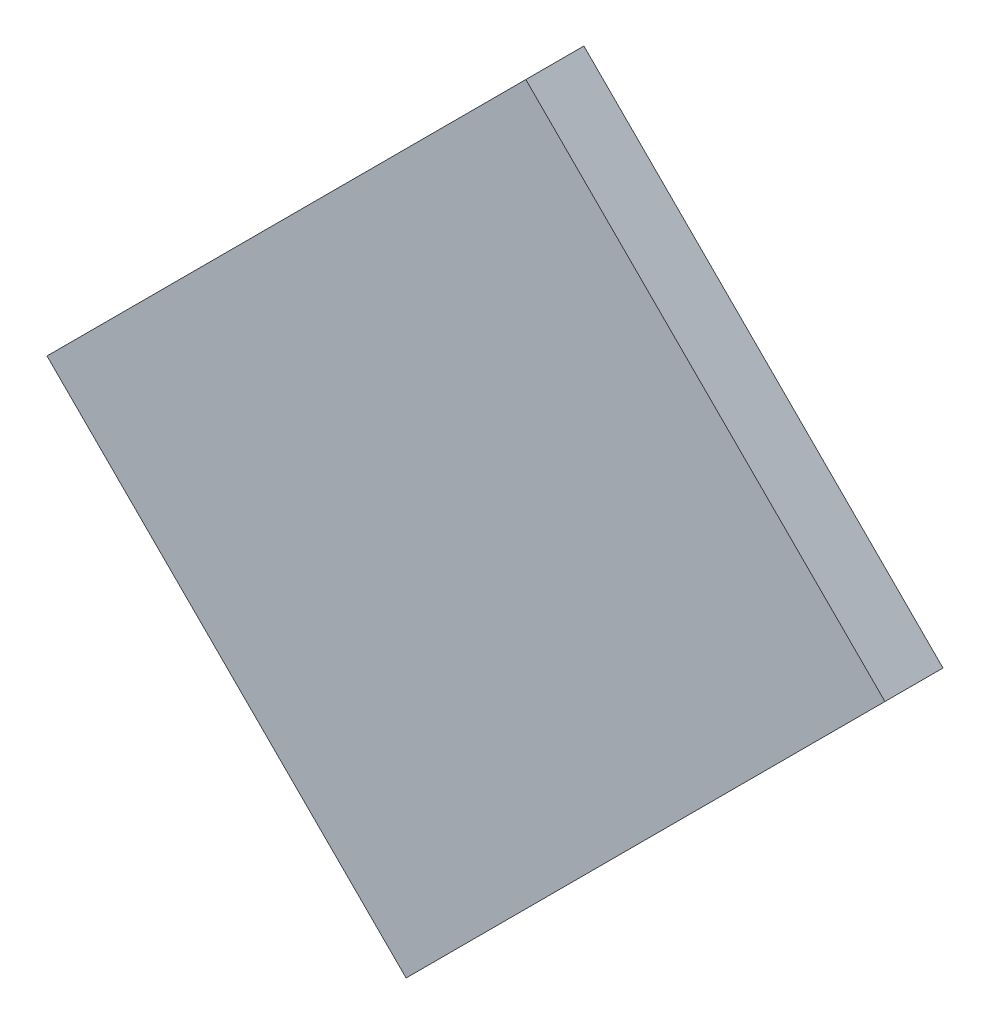
ISO-10303-21;
HEADER;
FILE_DESCRIPTION(('STEP AP214'),'2;1');
FILE_NAME('part.step','',(''),(''),'','','');
FILE_SCHEMA(('AUTOMOTIVE_DESIGN { 1 0 10303 214 1 1 1 1 }'));
ENDSEC;
DATA;
#1=APPLICATION_CONTEXT('core data for automotive mechanical design processes');
#2=APPLICATION_PROTOCOL_DEFINITION('international standard','automotive_design',2000,#1);
#3=PRODUCT_CONTEXT('',#1,'mechanical');
#4=PRODUCT('Part','Part','',(#3));
#5=PRODUCT_RELATED_PRODUCT_CATEGORY('part','',(#4));
#6=PRODUCT_DEFINITION_FORMATION('','',#4);
#7=PRODUCT_DEFINITION_CONTEXT('part definition',#1,'design');
#8=PRODUCT_DEFINITION('design','',#6,#7);
#9=PRODUCT_DEFINITION_SHAPE('','',#8);
#10=(LENGTH_UNIT() NAMED_UNIT(*) SI_UNIT(.MILLI.,.METRE.));
#11=(NAMED_UNIT(*) PLANE_ANGLE_UNIT() SI_UNIT($,.RADIAN.));
#12=(NAMED_UNIT(*) SI_UNIT($,.STERADIAN.) SOLID_ANGLE_UNIT());
#13=UNCERTAINTY_MEASURE_WITH_UNIT(LENGTH_MEASURE(1.E-05),#10,'distance_accuracy_value','');
#14=(GEOMETRIC_REPRESENTATION_CONTEXT(3) GLOBAL_UNCERTAINTY_ASSIGNED_CONTEXT((#13)) GLOBAL_UNIT_ASSIGNED_CONTEXT((#10,
#11,#12)) REPRESENTATION_CONTEXT('',''));
#15=CARTESIAN_POINT('',(0.,0.,0.));
#16=DIRECTION('',(0.,0.,1.));
#17=DIRECTION('',(1.,0.,0.));
#18=AXIS2_PLACEMENT_3D('',#15,#16,#17);
#19=CARTESIAN_POINT('',(7.6874546665,7.3975453335,0.79916));
#20=DIRECTION('',(0.,0.,1.));
#21=DIRECTION('',(0.,-1.,0.));
#22=AXIS2_PLACEMENT_3D('',#19,#20,#21);
#23=PLANE('',#22);
#24=DIRECTION('',(0.707106781186548,0.707106781186548,0.));
#25=VECTOR('',#24,1.);
#26=CARTESIAN_POINT('',(7.439967333,7.36219,0.79916));
#27=LINE('',#26,#25);
#28=CARTESIAN_POINT('',(7.72281,7.645032667,0.79916));
#29=VERTEX_POINT('',#28);
#30=CARTESIAN_POINT('',(7.439967333,7.36219,0.79916));
#31=VERTEX_POINT('',#30);
#32=EDGE_CURVE('E68',#29,#31,#27,.F.);
#33=ORIENTED_EDGE('',*,*,#32,.T.);
#34=DIRECTION('',(-0.707106781186548,0.707106781186548,0.));
#35=VECTOR('',#34,1.);
#36=CARTESIAN_POINT('',(7.652099333,7.150058,0.79916));
#37=LINE('',#36,#35);
#38=CARTESIAN_POINT('',(7.652099333,7.150058,0.79916));
#39=VERTEX_POINT('',#38);
#40=EDGE_CURVE('E55',#31,#39,#37,.F.);
#41=ORIENTED_EDGE('',*,*,#40,.T.);
#42=DIRECTION('',(-0.707106781186548,-0.707106781186548,0.));
#43=VECTOR('',#42,1.);
#44=CARTESIAN_POINT('',(7.934942,7.432900667,0.79916));
#45=LINE('',#44,#43);
#46=CARTESIAN_POINT('',(7.934942,7.432900667,0.79916));
#47=VERTEX_POINT('',#46);
#48=EDGE_CURVE('E20',#39,#47,#45,.F.);
#49=ORIENTED_EDGE('',*,*,#48,.T.);
#50=DIRECTION('',(0.707106781186548,-0.707106781186548,0.));
#51=VECTOR('',#50,1.);
#52=CARTESIAN_POINT('',(7.72281,7.645032667,0.79916));
#53=LINE('',#52,#51);
#54=EDGE_CURVE('E81',#47,#29,#53,.F.);
#55=ORIENTED_EDGE('',*,*,#54,.T.);
#56=EDGE_LOOP('',(#33,#41,#49,#55));
#57=FACE_BOUND('',#56,.T.);
#58=ADVANCED_FACE('F17',(#57),#23,.T.);
#59=CARTESIAN_POINT('',(7.934942,7.432900667,0.76487));
#60=DIRECTION('',(-0.707106781186548,0.707106781186548,0.));
#61=DIRECTION('',(-0.707106781186548,-0.707106781186548,0.));
#62=AXIS2_PLACEMENT_3D('',#59,#60,#61);
#63=PLANE('',#62);
#64=DIRECTION('',(0.,0.,1.));
#65=VECTOR('',#64,1.);
#66=CARTESIAN_POINT('',(7.652099333,7.150058,0.76487));
#67=LINE('',#66,#65);
#68=CARTESIAN_POINT('',(7.652099333,7.150058,0.76487));
#69=VERTEX_POINT('',#68);
#70=EDGE_CURVE('E61',#39,#69,#67,.F.);
#71=ORIENTED_EDGE('',*,*,#70,.T.);
#72=DIRECTION('',(-0.707106781186548,-0.707106781186548,0.));
#73=VECTOR('',#72,1.);
#74=CARTESIAN_POINT('',(7.934942,7.432900667,0.76487));
#75=LINE('',#74,#73);
#76=CARTESIAN_POINT('',(7.934942,7.432900667,0.76487));
#77=VERTEX_POINT('',#76);
#78=EDGE_CURVE('E83',#77,#69,#75,.T.);
#79=ORIENTED_EDGE('',*,*,#78,.F.);
#80=DIRECTION('',(0.,0.,1.));
#81=VECTOR('',#80,1.);
#82=CARTESIAN_POINT('',(7.934942,7.432900667,0.76487));
#83=LINE('',#82,#81);
#84=EDGE_CURVE('E64',#77,#47,#83,.T.);
#85=ORIENTED_EDGE('',*,*,#84,.T.);
#86=ORIENTED_EDGE('',*,*,#48,.F.);
#87=EDGE_LOOP('',(#71,#79,#85,#86));
#88=FACE_BOUND('',#87,.T.);
#89=ADVANCED_FACE('F60',(#88),#63,.F.);
#90=CARTESIAN_POINT('',(7.652099333,7.150058,0.76487));
#91=DIRECTION('',(0.707106781186548,0.707106781186548,0.));
#92=DIRECTION('',(-0.707106781186548,0.707106781186548,0.));
#93=AXIS2_PLACEMENT_3D('',#90,#91,#92);
#94=PLANE('',#93);
#95=DIRECTION('',(0.,0.,1.));
#96=VECTOR('',#95,1.);
#97=CARTESIAN_POINT('',(7.439967333,7.36219,0.76487));
#98=LINE('',#97,#96);
#99=CARTESIAN_POINT('',(7.439967333,7.36219,0.76487));
#100=VERTEX_POINT('',#99);
#101=EDGE_CURVE('E70',#31,#100,#98,.F.);
#102=ORIENTED_EDGE('',*,*,#101,.T.);
#103=DIRECTION('',(-0.707106781186546,0.707106781186549,0.));
#104=VECTOR('',#103,1.);
#105=CARTESIAN_POINT('',(7.652099333,7.150058,0.76487));
#106=LINE('',#105,#104);
#107=EDGE_CURVE('E74',#69,#100,#106,.T.);
#108=ORIENTED_EDGE('',*,*,#107,.F.);
#109=ORIENTED_EDGE('',*,*,#70,.F.);
#110=ORIENTED_EDGE('',*,*,#40,.F.);
#111=EDGE_LOOP('',(#102,#108,#109,#110));
#112=FACE_BOUND('',#111,.T.);
#113=ADVANCED_FACE('F72',(#112),#94,.F.);
#114=CARTESIAN_POINT('',(7.439967333,7.36219,0.76487));
#115=DIRECTION('',(0.707106781186548,-0.707106781186548,0.));
#116=DIRECTION('',(0.707106781186548,0.707106781186548,0.));
#117=AXIS2_PLACEMENT_3D('',#114,#115,#116);
#118=PLANE('',#117);
#119=DIRECTION('',(0.,0.,1.));
#120=VECTOR('',#119,1.);
#121=CARTESIAN_POINT('',(7.72281,7.645032667,0.76487));
#122=LINE('',#121,#120);
#123=CARTESIAN_POINT('',(7.72281,7.645032667,0.76487));
#124=VERTEX_POINT('',#123);
#125=EDGE_CURVE('E35',#29,#124,#122,.F.);
#126=ORIENTED_EDGE('',*,*,#125,.T.);
#127=DIRECTION('',(0.707106781186548,0.707106781186548,0.));
#128=VECTOR('',#127,1.);
#129=CARTESIAN_POINT('',(7.439967333,7.36219,0.76487));
#130=LINE('',#129,#128);
#131=EDGE_CURVE('E26',#100,#124,#130,.T.);
#132=ORIENTED_EDGE('',*,*,#131,.F.);
#133=ORIENTED_EDGE('',*,*,#101,.F.);
#134=ORIENTED_EDGE('',*,*,#32,.F.);
#135=EDGE_LOOP('',(#126,#132,#133,#134));
#136=FACE_BOUND('',#135,.T.);
#137=ADVANCED_FACE('F89',(#136),#118,.F.);
#138=CARTESIAN_POINT('',(7.72281,7.645032667,0.76487));
#139=DIRECTION('',(-0.707106781186548,-0.707106781186548,0.));
#140=DIRECTION('',(0.707106781186548,-0.707106781186548,0.));
#141=AXIS2_PLACEMENT_3D('',#138,#139,#140);
#142=PLANE('',#141);
#143=ORIENTED_EDGE('',*,*,#84,.F.);
#144=DIRECTION('',(0.707106781186549,-0.707106781186546,0.));
#145=VECTOR('',#144,1.);
#146=CARTESIAN_POINT('',(7.72281,7.645032667,0.76487));
#147=LINE('',#146,#145);
#148=EDGE_CURVE('E11',#124,#77,#147,.T.);
#149=ORIENTED_EDGE('',*,*,#148,.F.);
#150=ORIENTED_EDGE('',*,*,#125,.F.);
#151=ORIENTED_EDGE('',*,*,#54,.F.);
#152=EDGE_LOOP('',(#143,#149,#150,#151));
#153=FACE_BOUND('',#152,.T.);
#154=ADVANCED_FACE('F91',(#153),#142,.F.);
#155=CARTESIAN_POINT('',(7.6874546665,7.3975453335,0.76487));
#156=DIRECTION('',(0.,0.,-1.));
#157=DIRECTION('',(0.,1.,0.));
#158=AXIS2_PLACEMENT_3D('',#155,#156,#157);
#159=PLANE('',#158);
#160=ORIENTED_EDGE('',*,*,#131,.T.);
#161=ORIENTED_EDGE('',*,*,#148,.T.);
#162=ORIENTED_EDGE('',*,*,#78,.T.);
#163=ORIENTED_EDGE('',*,*,#107,.T.);
#164=EDGE_LOOP('',(#160,#161,#162,#163));
#165=FACE_BOUND('',#164,.T.);
#166=ADVANCED_FACE('F88',(#165),#159,.T.);
#167=CLOSED_SHELL('',(#58,#89,#113,#137,#154,#166));
#168=MANIFOLD_SOLID_BREP('B1',#167);
#169=ADVANCED_BREP_SHAPE_REPRESENTATION('',(#18,#168),#14);
#170=SHAPE_DEFINITION_REPRESENTATION(#9,#169);
ENDSEC;
END-ISO-10303-21;
